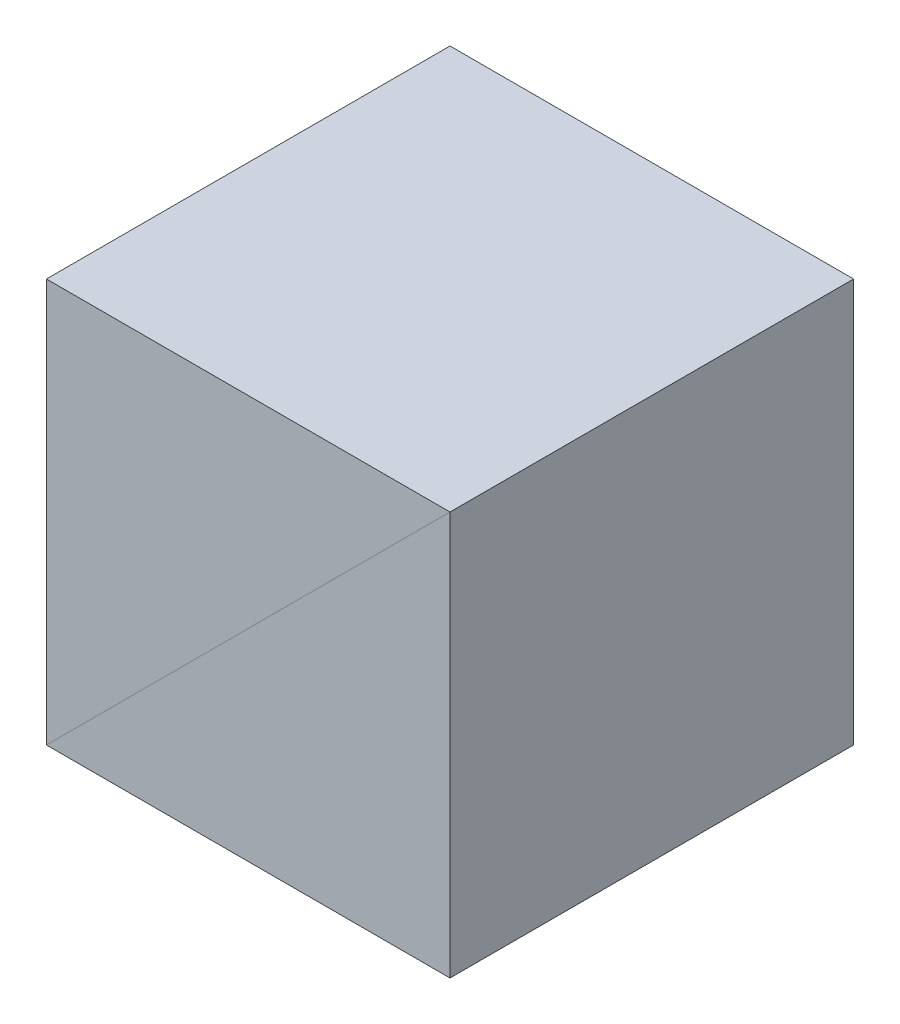
ISO-10303-21;
HEADER;
FILE_DESCRIPTION(('STEP AP214'),'2;1');
FILE_NAME('part.step','',(''),(''),'','','');
FILE_SCHEMA(('AUTOMOTIVE_DESIGN { 1 0 10303 214 1 1 1 1 }'));
ENDSEC;
DATA;
#1=APPLICATION_CONTEXT('core data for automotive mechanical design processes');
#2=APPLICATION_PROTOCOL_DEFINITION('international standard','automotive_design',2000,#1);
#3=PRODUCT_CONTEXT('',#1,'mechanical');
#4=PRODUCT('Part','Part','',(#3));
#5=PRODUCT_RELATED_PRODUCT_CATEGORY('part','',(#4));
#6=PRODUCT_DEFINITION_FORMATION('','',#4);
#7=PRODUCT_DEFINITION_CONTEXT('part definition',#1,'design');
#8=PRODUCT_DEFINITION('design','',#6,#7);
#9=PRODUCT_DEFINITION_SHAPE('','',#8);
#10=(LENGTH_UNIT() NAMED_UNIT(*) SI_UNIT(.MILLI.,.METRE.));
#11=(NAMED_UNIT(*) PLANE_ANGLE_UNIT() SI_UNIT($,.RADIAN.));
#12=(NAMED_UNIT(*) SI_UNIT($,.STERADIAN.) SOLID_ANGLE_UNIT());
#13=UNCERTAINTY_MEASURE_WITH_UNIT(LENGTH_MEASURE(1.E-05),#10,'distance_accuracy_value','');
#14=(GEOMETRIC_REPRESENTATION_CONTEXT(3) GLOBAL_UNCERTAINTY_ASSIGNED_CONTEXT((#13)) GLOBAL_UNIT_ASSIGNED_CONTEXT((#10,
#11,#12)) REPRESENTATION_CONTEXT('',''));
#15=CARTESIAN_POINT('',(0.,0.,0.));
#16=DIRECTION('',(0.,0.,1.));
#17=DIRECTION('',(1.,0.,0.));
#18=AXIS2_PLACEMENT_3D('',#15,#16,#17);
#19=CARTESIAN_POINT('',(12.7,12.7,12.7));
#20=DIRECTION('',(-0.707106781186548,0.707106781186548,0.));
#21=DIRECTION('',(0.707106781186547,0.707106781186547,0.));
#22=AXIS2_PLACEMENT_3D('',#19,#20,#21);
#23=PLANE('',#22);
#24=DIRECTION('',(-0.707106781186547,-0.707106781186547,0.));
#25=VECTOR('',#24,1.);
#26=CARTESIAN_POINT('',(12.7,12.7,-12.7));
#27=LINE('',#26,#25);
#28=CARTESIAN_POINT('',(12.7,12.7,-12.7));
#29=VERTEX_POINT('',#28);
#30=CARTESIAN_POINT('',(-12.7,-12.7,-12.7));
#31=VERTEX_POINT('',#30);
#32=EDGE_CURVE('E101',#29,#31,#27,.T.);
#33=ORIENTED_EDGE('',*,*,#32,.F.);
#34=DIRECTION('',(0.,0.,-1.));
#35=VECTOR('',#34,1.);
#36=CARTESIAN_POINT('',(12.7,12.7,12.7));
#37=LINE('',#36,#35);
#38=CARTESIAN_POINT('',(12.7,12.7,12.7));
#39=VERTEX_POINT('',#38);
#40=EDGE_CURVE('E96',#39,#29,#37,.T.);
#41=ORIENTED_EDGE('',*,*,#40,.F.);
#42=DIRECTION('',(-0.707106781186547,-0.707106781186547,0.));
#43=VECTOR('',#42,1.);
#44=CARTESIAN_POINT('',(12.7,12.7,12.7));
#45=LINE('',#44,#43);
#46=CARTESIAN_POINT('',(-12.7,-12.7,12.7));
#47=VERTEX_POINT('',#46);
#48=EDGE_CURVE('E88',#39,#47,#45,.T.);
#49=ORIENTED_EDGE('',*,*,#48,.T.);
#50=DIRECTION('',(0.,0.,-1.));
#51=VECTOR('',#50,1.);
#52=CARTESIAN_POINT('',(-12.7,-12.7,12.7));
#53=LINE('',#52,#51);
#54=EDGE_CURVE('E12',#47,#31,#53,.T.);
#55=ORIENTED_EDGE('',*,*,#54,.T.);
#56=EDGE_LOOP('',(#33,#41,#49,#55));
#57=FACE_BOUND('',#56,.T.);
#58=ADVANCED_FACE('F49',(#57),#23,.F.);
#59=CARTESIAN_POINT('',(-12.7,-12.7,12.7));
#60=DIRECTION('',(1.,0.,0.));
#61=DIRECTION('',(0.,0.,1.));
#62=AXIS2_PLACEMENT_3D('',#59,#60,#61);
#63=PLANE('',#62);
#64=DIRECTION('',(0.,1.,0.));
#65=VECTOR('',#64,1.);
#66=CARTESIAN_POINT('',(-12.7,-12.7,-12.7));
#67=LINE('',#66,#65);
#68=CARTESIAN_POINT('',(-12.7,12.7,-12.7));
#69=VERTEX_POINT('',#68);
#70=EDGE_CURVE('E93',#31,#69,#67,.T.);
#71=ORIENTED_EDGE('',*,*,#70,.F.);
#72=ORIENTED_EDGE('',*,*,#54,.F.);
#73=DIRECTION('',(0.,1.,0.));
#74=VECTOR('',#73,1.);
#75=CARTESIAN_POINT('',(-12.7,-12.7,12.7));
#76=LINE('',#75,#74);
#77=CARTESIAN_POINT('',(-12.7,12.7,12.7));
#78=VERTEX_POINT('',#77);
#79=EDGE_CURVE('E84',#47,#78,#76,.T.);
#80=ORIENTED_EDGE('',*,*,#79,.T.);
#81=DIRECTION('',(0.,0.,-1.));
#82=VECTOR('',#81,1.);
#83=CARTESIAN_POINT('',(-12.7,12.7,12.7));
#84=LINE('',#83,#82);
#85=EDGE_CURVE('E57',#78,#69,#84,.T.);
#86=ORIENTED_EDGE('',*,*,#85,.T.);
#87=EDGE_LOOP('',(#71,#72,#80,#86));
#88=FACE_BOUND('',#87,.T.);
#89=ADVANCED_FACE('F92',(#88),#63,.F.);
#90=CARTESIAN_POINT('',(12.7,12.7,12.7));
#91=DIRECTION('',(0.,-1.,0.));
#92=DIRECTION('',(0.,0.,1.));
#93=AXIS2_PLACEMENT_3D('',#90,#91,#92);
#94=PLANE('',#93);
#95=DIRECTION('',(1.,0.,0.));
#96=VECTOR('',#95,1.);
#97=CARTESIAN_POINT('',(12.7,12.7,-12.7));
#98=LINE('',#97,#96);
#99=EDGE_CURVE('E76',#69,#29,#98,.T.);
#100=ORIENTED_EDGE('',*,*,#99,.F.);
#101=ORIENTED_EDGE('',*,*,#85,.F.);
#102=DIRECTION('',(1.,0.,0.));
#103=VECTOR('',#102,1.);
#104=CARTESIAN_POINT('',(12.7,12.7,12.7));
#105=LINE('',#104,#103);
#106=EDGE_CURVE('E65',#78,#39,#105,.T.);
#107=ORIENTED_EDGE('',*,*,#106,.T.);
#108=ORIENTED_EDGE('',*,*,#40,.T.);
#109=EDGE_LOOP('',(#100,#101,#107,#108));
#110=FACE_BOUND('',#109,.T.);
#111=ADVANCED_FACE('F110',(#110),#94,.F.);
#112=CARTESIAN_POINT('',(0.,0.,12.7));
#113=DIRECTION('',(0.,0.,1.));
#114=DIRECTION('',(0.,1.,0.));
#115=AXIS2_PLACEMENT_3D('',#112,#113,#114);
#116=PLANE('',#115);
#117=ORIENTED_EDGE('',*,*,#48,.F.);
#118=ORIENTED_EDGE('',*,*,#106,.F.);
#119=ORIENTED_EDGE('',*,*,#79,.F.);
#120=EDGE_LOOP('',(#117,#118,#119));
#121=FACE_BOUND('',#120,.T.);
#122=ADVANCED_FACE('F86',(#121),#116,.T.);
#123=CARTESIAN_POINT('',(0.,0.,-12.7));
#124=DIRECTION('',(0.,0.,1.));
#125=DIRECTION('',(0.,1.,0.));
#126=AXIS2_PLACEMENT_3D('',#123,#124,#125);
#127=PLANE('',#126);
#128=ORIENTED_EDGE('',*,*,#32,.T.);
#129=ORIENTED_EDGE('',*,*,#70,.T.);
#130=ORIENTED_EDGE('',*,*,#99,.T.);
#131=EDGE_LOOP('',(#128,#129,#130));
#132=FACE_BOUND('',#131,.T.);
#133=ADVANCED_FACE('F104',(#132),#127,.F.);
#134=CLOSED_SHELL('',(#58,#89,#111,#122,#133));
#135=MANIFOLD_SOLID_BREP('B2',#134);
#136=CARTESIAN_POINT('',(12.7,12.7,12.7));
#137=DIRECTION('',(0.707106781186548,-0.707106781186548,0.));
#138=DIRECTION('',(0.707106781186548,0.707106781186548,0.));
#139=AXIS2_PLACEMENT_3D('',#136,#137,#138);
#140=PLANE('',#139);
#141=DIRECTION('',(-0.707106781186547,-0.707106781186547,0.));
#142=VECTOR('',#141,1.);
#143=CARTESIAN_POINT('',(12.7,12.7,-12.7));
#144=LINE('',#143,#142);
#145=CARTESIAN_POINT('',(12.7,12.7,-12.7));
#146=VERTEX_POINT('',#145);
#147=CARTESIAN_POINT('',(-12.7,-12.7,-12.7));
#148=VERTEX_POINT('',#147);
#149=EDGE_CURVE('E197',#146,#148,#144,.T.);
#150=ORIENTED_EDGE('',*,*,#149,.T.);
#151=DIRECTION('',(0.,0.,-1.));
#152=VECTOR('',#151,1.);
#153=CARTESIAN_POINT('',(-12.7,-12.7,12.7));
#154=LINE('',#153,#152);
#155=CARTESIAN_POINT('',(-12.7,-12.7,12.7));
#156=VERTEX_POINT('',#155);
#157=EDGE_CURVE('E47',#156,#148,#154,.T.);
#158=ORIENTED_EDGE('',*,*,#157,.F.);
#159=DIRECTION('',(-0.707106781186547,-0.707106781186547,0.));
#160=VECTOR('',#159,1.);
#161=CARTESIAN_POINT('',(12.7,12.7,12.7));
#162=LINE('',#161,#160);
#163=CARTESIAN_POINT('',(12.7,12.7,12.7));
#164=VERTEX_POINT('',#163);
#165=EDGE_CURVE('E189',#164,#156,#162,.T.);
#166=ORIENTED_EDGE('',*,*,#165,.F.);
#167=DIRECTION('',(0.,0.,-1.));
#168=VECTOR('',#167,1.);
#169=CARTESIAN_POINT('',(12.7,12.7,12.7));
#170=LINE('',#169,#168);
#171=EDGE_CURVE('E198',#164,#146,#170,.T.);
#172=ORIENTED_EDGE('',*,*,#171,.T.);
#173=EDGE_LOOP('',(#150,#158,#166,#172));
#174=FACE_BOUND('',#173,.T.);
#175=ADVANCED_FACE('F147',(#174),#140,.F.);
#176=CARTESIAN_POINT('',(-12.7,-12.7,12.7));
#177=DIRECTION('',(0.,1.,0.));
#178=DIRECTION('',(0.,0.,1.));
#179=AXIS2_PLACEMENT_3D('',#176,#177,#178);
#180=PLANE('',#179);
#181=DIRECTION('',(1.,0.,0.));
#182=VECTOR('',#181,1.);
#183=CARTESIAN_POINT('',(-12.7,-12.7,-12.7));
#184=LINE('',#183,#182);
#185=CARTESIAN_POINT('',(12.7,-12.7,-12.7));
#186=VERTEX_POINT('',#185);
#187=EDGE_CURVE('E176',#148,#186,#184,.T.);
#188=ORIENTED_EDGE('',*,*,#187,.T.);
#189=DIRECTION('',(0.,0.,-1.));
#190=VECTOR('',#189,1.);
#191=CARTESIAN_POINT('',(12.7,-12.7,12.7));
#192=LINE('',#191,#190);
#193=CARTESIAN_POINT('',(12.7,-12.7,12.7));
#194=VERTEX_POINT('',#193);
#195=EDGE_CURVE('E156',#194,#186,#192,.T.);
#196=ORIENTED_EDGE('',*,*,#195,.F.);
#197=DIRECTION('',(1.,0.,0.));
#198=VECTOR('',#197,1.);
#199=CARTESIAN_POINT('',(-12.7,-12.7,12.7));
#200=LINE('',#199,#198);
#201=EDGE_CURVE('E184',#156,#194,#200,.T.);
#202=ORIENTED_EDGE('',*,*,#201,.F.);
#203=ORIENTED_EDGE('',*,*,#157,.T.);
#204=EDGE_LOOP('',(#188,#196,#202,#203));
#205=FACE_BOUND('',#204,.T.);
#206=ADVANCED_FACE('F185',(#205),#180,.F.);
#207=CARTESIAN_POINT('',(12.7,12.7,12.7));
#208=DIRECTION('',(-1.,0.,0.));
#209=DIRECTION('',(0.,0.,1.));
#210=AXIS2_PLACEMENT_3D('',#207,#208,#209);
#211=PLANE('',#210);
#212=DIRECTION('',(0.,1.,0.));
#213=VECTOR('',#212,1.);
#214=CARTESIAN_POINT('',(12.7,12.7,-12.7));
#215=LINE('',#214,#213);
#216=EDGE_CURVE('E181',#186,#146,#215,.T.);
#217=ORIENTED_EDGE('',*,*,#216,.T.);
#218=ORIENTED_EDGE('',*,*,#171,.F.);
#219=DIRECTION('',(0.,1.,0.));
#220=VECTOR('',#219,1.);
#221=CARTESIAN_POINT('',(12.7,12.7,12.7));
#222=LINE('',#221,#220);
#223=EDGE_CURVE('E164',#194,#164,#222,.T.);
#224=ORIENTED_EDGE('',*,*,#223,.F.);
#225=ORIENTED_EDGE('',*,*,#195,.T.);
#226=EDGE_LOOP('',(#217,#218,#224,#225));
#227=FACE_BOUND('',#226,.T.);
#228=ADVANCED_FACE('F210',(#227),#211,.F.);
#229=CARTESIAN_POINT('',(0.,0.,12.7));
#230=DIRECTION('',(0.,0.,1.));
#231=DIRECTION('',(1.,0.,0.));
#232=AXIS2_PLACEMENT_3D('',#229,#230,#231);
#233=PLANE('',#232);
#234=ORIENTED_EDGE('',*,*,#165,.T.);
#235=ORIENTED_EDGE('',*,*,#201,.T.);
#236=ORIENTED_EDGE('',*,*,#223,.T.);
#237=EDGE_LOOP('',(#234,#235,#236));
#238=FACE_BOUND('',#237,.T.);
#239=ADVANCED_FACE('F192',(#238),#233,.T.);
#240=CARTESIAN_POINT('',(0.,0.,-12.7));
#241=DIRECTION('',(0.,0.,1.));
#242=DIRECTION('',(1.,0.,0.));
#243=AXIS2_PLACEMENT_3D('',#240,#241,#242);
#244=PLANE('',#243);
#245=ORIENTED_EDGE('',*,*,#149,.F.);
#246=ORIENTED_EDGE('',*,*,#216,.F.);
#247=ORIENTED_EDGE('',*,*,#187,.F.);
#248=EDGE_LOOP('',(#245,#246,#247));
#249=FACE_BOUND('',#248,.T.);
#250=ADVANCED_FACE('F211',(#249),#244,.F.);
#251=CLOSED_SHELL('',(#175,#206,#228,#239,#250));
#252=MANIFOLD_SOLID_BREP('B6',#251);
#253=ADVANCED_BREP_SHAPE_REPRESENTATION('',(#18,#135,#252),#14);
#254=SHAPE_DEFINITION_REPRESENTATION(#9,#253);
ENDSEC;
END-ISO-10303-21;
